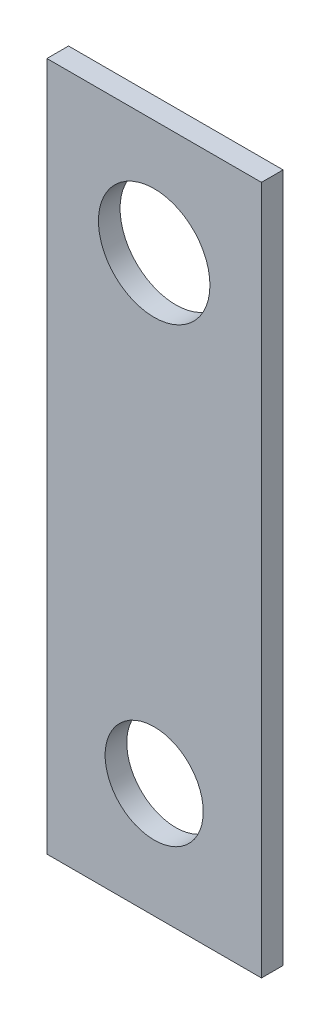
ISO-10303-21;
HEADER;
FILE_DESCRIPTION(('STEP AP214'),'2;1');
FILE_NAME('part.step','',(''),(''),'','','');
FILE_SCHEMA(('AUTOMOTIVE_DESIGN { 1 0 10303 214 1 1 1 1 }'));
ENDSEC;
DATA;
#1=APPLICATION_CONTEXT('core data for automotive mechanical design processes');
#2=APPLICATION_PROTOCOL_DEFINITION('international standard','automotive_design',2000,#1);
#3=PRODUCT_CONTEXT('',#1,'mechanical');
#4=PRODUCT('Part','Part','',(#3));
#5=PRODUCT_RELATED_PRODUCT_CATEGORY('part','',(#4));
#6=PRODUCT_DEFINITION_FORMATION('','',#4);
#7=PRODUCT_DEFINITION_CONTEXT('part definition',#1,'design');
#8=PRODUCT_DEFINITION('design','',#6,#7);
#9=PRODUCT_DEFINITION_SHAPE('','',#8);
#10=(LENGTH_UNIT() NAMED_UNIT(*) SI_UNIT(.MILLI.,.METRE.));
#11=(NAMED_UNIT(*) PLANE_ANGLE_UNIT() SI_UNIT($,.RADIAN.));
#12=(NAMED_UNIT(*) SI_UNIT($,.STERADIAN.) SOLID_ANGLE_UNIT());
#13=UNCERTAINTY_MEASURE_WITH_UNIT(LENGTH_MEASURE(1.E-05),#10,'distance_accuracy_value','');
#14=(GEOMETRIC_REPRESENTATION_CONTEXT(3) GLOBAL_UNCERTAINTY_ASSIGNED_CONTEXT((#13)) GLOBAL_UNIT_ASSIGNED_CONTEXT((#10,
#11,#12)) REPRESENTATION_CONTEXT('',''));
#15=CARTESIAN_POINT('',(0.,0.,0.));
#16=DIRECTION('',(0.,0.,1.));
#17=DIRECTION('',(1.,0.,0.));
#18=AXIS2_PLACEMENT_3D('',#15,#16,#17);
#19=CARTESIAN_POINT('',(0.,0.,1.016));
#20=DIRECTION('',(0.,0.,1.));
#21=DIRECTION('',(1.,0.,0.));
#22=AXIS2_PLACEMENT_3D('',#19,#20,#21);
#23=PLANE('',#22);
#24=CARTESIAN_POINT('',(5.0419,-5.3975,1.016));
#25=DIRECTION('',(0.,0.,1.));
#26=DIRECTION('',(1.,0.,0.));
#27=AXIS2_PLACEMENT_3D('',#24,#25,#26);
#28=CIRCLE('',#27,2.6198910488983);
#29=CARTESIAN_POINT('',(7.6617910488983,-5.3975,1.016));
#30=VERTEX_POINT('',#29);
#31=EDGE_CURVE('E112',#30,#30,#28,.T.);
#32=ORIENTED_EDGE('',*,*,#31,.F.);
#33=EDGE_LOOP('',(#32));
#34=FACE_BOUND('',#33,.T.);
#35=DIRECTION('',(0.,-1.,0.));
#36=VECTOR('',#35,1.);
#37=CARTESIAN_POINT('',(0.,0.,1.016));
#38=LINE('',#37,#36);
#39=CARTESIAN_POINT('',(0.,0.,1.016));
#40=VERTEX_POINT('',#39);
#41=CARTESIAN_POINT('',(0.,-32.385,1.016));
#42=VERTEX_POINT('',#41);
#43=EDGE_CURVE('E92',#40,#42,#38,.T.);
#44=ORIENTED_EDGE('',*,*,#43,.T.);
#45=DIRECTION('',(1.,0.,0.));
#46=VECTOR('',#45,1.);
#47=CARTESIAN_POINT('',(0.,-32.385,1.016));
#48=LINE('',#47,#46);
#49=CARTESIAN_POINT('',(10.0838,-32.385,1.016));
#50=VERTEX_POINT('',#49);
#51=EDGE_CURVE('E87',#42,#50,#48,.T.);
#52=ORIENTED_EDGE('',*,*,#51,.T.);
#53=DIRECTION('',(0.,1.,0.));
#54=VECTOR('',#53,1.);
#55=CARTESIAN_POINT('',(10.0838,0.,1.016));
#56=LINE('',#55,#54);
#57=CARTESIAN_POINT('',(10.0838,0.,1.016));
#58=VERTEX_POINT('',#57);
#59=EDGE_CURVE('E90',#50,#58,#56,.T.);
#60=ORIENTED_EDGE('',*,*,#59,.T.);
#61=DIRECTION('',(-1.,0.,0.));
#62=VECTOR('',#61,1.);
#63=CARTESIAN_POINT('',(0.,0.,1.016));
#64=LINE('',#63,#62);
#65=EDGE_CURVE('E57',#58,#40,#64,.T.);
#66=ORIENTED_EDGE('',*,*,#65,.T.);
#67=EDGE_LOOP('',(#44,#52,#60,#66));
#68=FACE_BOUND('',#67,.T.);
#69=CARTESIAN_POINT('',(5.0419,-26.9875,1.016));
#70=DIRECTION('',(0.,0.,1.));
#71=DIRECTION('',(1.,0.,0.));
#72=AXIS2_PLACEMENT_3D('',#69,#70,#71);
#73=CIRCLE('',#72,2.30548173612988);
#74=CARTESIAN_POINT('',(7.34738173612988,-26.9875,1.016));
#75=VERTEX_POINT('',#74);
#76=EDGE_CURVE('E134',#75,#75,#73,.T.);
#77=ORIENTED_EDGE('',*,*,#76,.F.);
#78=EDGE_LOOP('',(#77));
#79=FACE_BOUND('',#78,.T.);
#80=ADVANCED_FACE('F39',(#34,#68,#79),#23,.T.);
#81=CARTESIAN_POINT('',(0.,0.,0.));
#82=DIRECTION('',(0.,0.,1.));
#83=DIRECTION('',(1.,0.,0.));
#84=AXIS2_PLACEMENT_3D('',#81,#82,#83);
#85=PLANE('',#84);
#86=DIRECTION('',(0.,-1.,0.));
#87=VECTOR('',#86,1.);
#88=CARTESIAN_POINT('',(0.,0.,0.));
#89=LINE('',#88,#87);
#90=CARTESIAN_POINT('',(0.,0.,0.));
#91=VERTEX_POINT('',#90);
#92=CARTESIAN_POINT('',(0.,-32.385,0.));
#93=VERTEX_POINT('',#92);
#94=EDGE_CURVE('E108',#91,#93,#89,.T.);
#95=ORIENTED_EDGE('',*,*,#94,.F.);
#96=DIRECTION('',(-1.,0.,0.));
#97=VECTOR('',#96,1.);
#98=CARTESIAN_POINT('',(0.,0.,0.));
#99=LINE('',#98,#97);
#100=CARTESIAN_POINT('',(10.0838,0.,0.));
#101=VERTEX_POINT('',#100);
#102=EDGE_CURVE('E80',#101,#91,#99,.T.);
#103=ORIENTED_EDGE('',*,*,#102,.F.);
#104=DIRECTION('',(0.,1.,0.));
#105=VECTOR('',#104,1.);
#106=CARTESIAN_POINT('',(10.0838,0.,0.));
#107=LINE('',#106,#105);
#108=CARTESIAN_POINT('',(10.0838,-32.385,0.));
#109=VERTEX_POINT('',#108);
#110=EDGE_CURVE('E74',#109,#101,#107,.T.);
#111=ORIENTED_EDGE('',*,*,#110,.F.);
#112=DIRECTION('',(1.,0.,0.));
#113=VECTOR('',#112,1.);
#114=CARTESIAN_POINT('',(0.,-32.385,0.));
#115=LINE('',#114,#113);
#116=EDGE_CURVE('E97',#93,#109,#115,.T.);
#117=ORIENTED_EDGE('',*,*,#116,.F.);
#118=EDGE_LOOP('',(#95,#103,#111,#117));
#119=FACE_BOUND('',#118,.T.);
#120=CARTESIAN_POINT('',(5.0419,-5.3975,0.));
#121=DIRECTION('',(0.,0.,1.));
#122=DIRECTION('',(1.,0.,0.));
#123=AXIS2_PLACEMENT_3D('',#120,#121,#122);
#124=CIRCLE('',#123,2.6198910488983);
#125=CARTESIAN_POINT('',(7.6617910488983,-5.3975,0.));
#126=VERTEX_POINT('',#125);
#127=EDGE_CURVE('E130',#126,#126,#124,.T.);
#128=ORIENTED_EDGE('',*,*,#127,.T.);
#129=EDGE_LOOP('',(#128));
#130=FACE_BOUND('',#129,.T.);
#131=CARTESIAN_POINT('',(5.0419,-26.9875,0.));
#132=DIRECTION('',(0.,0.,1.));
#133=DIRECTION('',(1.,0.,0.));
#134=AXIS2_PLACEMENT_3D('',#131,#132,#133);
#135=CIRCLE('',#134,2.30548173612988);
#136=CARTESIAN_POINT('',(7.34738173612988,-26.9875,0.));
#137=VERTEX_POINT('',#136);
#138=EDGE_CURVE('E138',#137,#137,#135,.T.);
#139=ORIENTED_EDGE('',*,*,#138,.T.);
#140=EDGE_LOOP('',(#139));
#141=FACE_BOUND('',#140,.T.);
#142=ADVANCED_FACE('F125',(#119,#130,#141),#85,.F.);
#143=CARTESIAN_POINT('',(0.,0.,1.016));
#144=DIRECTION('',(1.,0.,0.));
#145=DIRECTION('',(0.,1.,0.));
#146=AXIS2_PLACEMENT_3D('',#143,#144,#145);
#147=PLANE('',#146);
#148=ORIENTED_EDGE('',*,*,#94,.T.);
#149=DIRECTION('',(0.,0.,-1.));
#150=VECTOR('',#149,1.);
#151=CARTESIAN_POINT('',(0.,-32.385,1.016));
#152=LINE('',#151,#150);
#153=EDGE_CURVE('E11',#42,#93,#152,.T.);
#154=ORIENTED_EDGE('',*,*,#153,.F.);
#155=ORIENTED_EDGE('',*,*,#43,.F.);
#156=DIRECTION('',(0.,0.,-1.));
#157=VECTOR('',#156,1.);
#158=CARTESIAN_POINT('',(0.,0.,1.016));
#159=LINE('',#158,#157);
#160=EDGE_CURVE('E104',#40,#91,#159,.T.);
#161=ORIENTED_EDGE('',*,*,#160,.T.);
#162=EDGE_LOOP('',(#148,#154,#155,#161));
#163=FACE_BOUND('',#162,.T.);
#164=ADVANCED_FACE('F41',(#163),#147,.F.);
#165=CARTESIAN_POINT('',(0.,-32.385,1.016));
#166=DIRECTION('',(0.,1.,0.));
#167=DIRECTION('',(0.,0.,1.));
#168=AXIS2_PLACEMENT_3D('',#165,#166,#167);
#169=PLANE('',#168);
#170=ORIENTED_EDGE('',*,*,#116,.T.);
#171=DIRECTION('',(0.,0.,-1.));
#172=VECTOR('',#171,1.);
#173=CARTESIAN_POINT('',(10.0838,-32.385,1.016));
#174=LINE('',#173,#172);
#175=EDGE_CURVE('E49',#50,#109,#174,.T.);
#176=ORIENTED_EDGE('',*,*,#175,.F.);
#177=ORIENTED_EDGE('',*,*,#51,.F.);
#178=ORIENTED_EDGE('',*,*,#153,.T.);
#179=EDGE_LOOP('',(#170,#176,#177,#178));
#180=FACE_BOUND('',#179,.T.);
#181=ADVANCED_FACE('F96',(#180),#169,.F.);
#182=CARTESIAN_POINT('',(10.0838,0.,1.016));
#183=DIRECTION('',(-1.,0.,0.));
#184=DIRECTION('',(0.,0.,1.));
#185=AXIS2_PLACEMENT_3D('',#182,#183,#184);
#186=PLANE('',#185);
#187=ORIENTED_EDGE('',*,*,#110,.T.);
#188=DIRECTION('',(0.,0.,-1.));
#189=VECTOR('',#188,1.);
#190=CARTESIAN_POINT('',(10.0838,0.,1.016));
#191=LINE('',#190,#189);
#192=EDGE_CURVE('E99',#58,#101,#191,.T.);
#193=ORIENTED_EDGE('',*,*,#192,.F.);
#194=ORIENTED_EDGE('',*,*,#59,.F.);
#195=ORIENTED_EDGE('',*,*,#175,.T.);
#196=EDGE_LOOP('',(#187,#193,#194,#195));
#197=FACE_BOUND('',#196,.T.);
#198=ADVANCED_FACE('F100',(#197),#186,.F.);
#199=CARTESIAN_POINT('',(0.,0.,1.016));
#200=DIRECTION('',(0.,-1.,0.));
#201=DIRECTION('',(0.,0.,-1.));
#202=AXIS2_PLACEMENT_3D('',#199,#200,#201);
#203=PLANE('',#202);
#204=ORIENTED_EDGE('',*,*,#102,.T.);
#205=ORIENTED_EDGE('',*,*,#160,.F.);
#206=ORIENTED_EDGE('',*,*,#65,.F.);
#207=ORIENTED_EDGE('',*,*,#192,.T.);
#208=EDGE_LOOP('',(#204,#205,#206,#207));
#209=FACE_BOUND('',#208,.T.);
#210=ADVANCED_FACE('F122',(#209),#203,.F.);
#211=CARTESIAN_POINT('',(5.0419,-5.3975,1.016));
#212=DIRECTION('',(0.,0.,-1.));
#213=DIRECTION('',(-1.,0.,0.));
#214=AXIS2_PLACEMENT_3D('',#211,#212,#213);
#215=CYLINDRICAL_SURFACE('',#214,2.6198910488983);
#216=ORIENTED_EDGE('',*,*,#31,.T.);
#217=EDGE_LOOP('',(#216));
#218=FACE_BOUND('',#217,.T.);
#219=ORIENTED_EDGE('',*,*,#127,.F.);
#220=EDGE_LOOP('',(#219));
#221=FACE_BOUND('',#220,.T.);
#222=ADVANCED_FACE('F157',(#218,#221),#215,.F.);
#223=CARTESIAN_POINT('',(5.0419,-26.9875,1.016));
#224=DIRECTION('',(0.,0.,-1.));
#225=DIRECTION('',(-1.,0.,0.));
#226=AXIS2_PLACEMENT_3D('',#223,#224,#225);
#227=CYLINDRICAL_SURFACE('',#226,2.30548173612988);
#228=ORIENTED_EDGE('',*,*,#76,.T.);
#229=EDGE_LOOP('',(#228));
#230=FACE_BOUND('',#229,.T.);
#231=ORIENTED_EDGE('',*,*,#138,.F.);
#232=EDGE_LOOP('',(#231));
#233=FACE_BOUND('',#232,.T.);
#234=ADVANCED_FACE('F146',(#230,#233),#227,.F.);
#235=CLOSED_SHELL('',(#80,#142,#164,#181,#198,#210,#222,#234));
#236=MANIFOLD_SOLID_BREP('B2',#235);
#237=ADVANCED_BREP_SHAPE_REPRESENTATION('',(#18,#236),#14);
#238=SHAPE_DEFINITION_REPRESENTATION(#9,#237);
ENDSEC;
END-ISO-10303-21;
